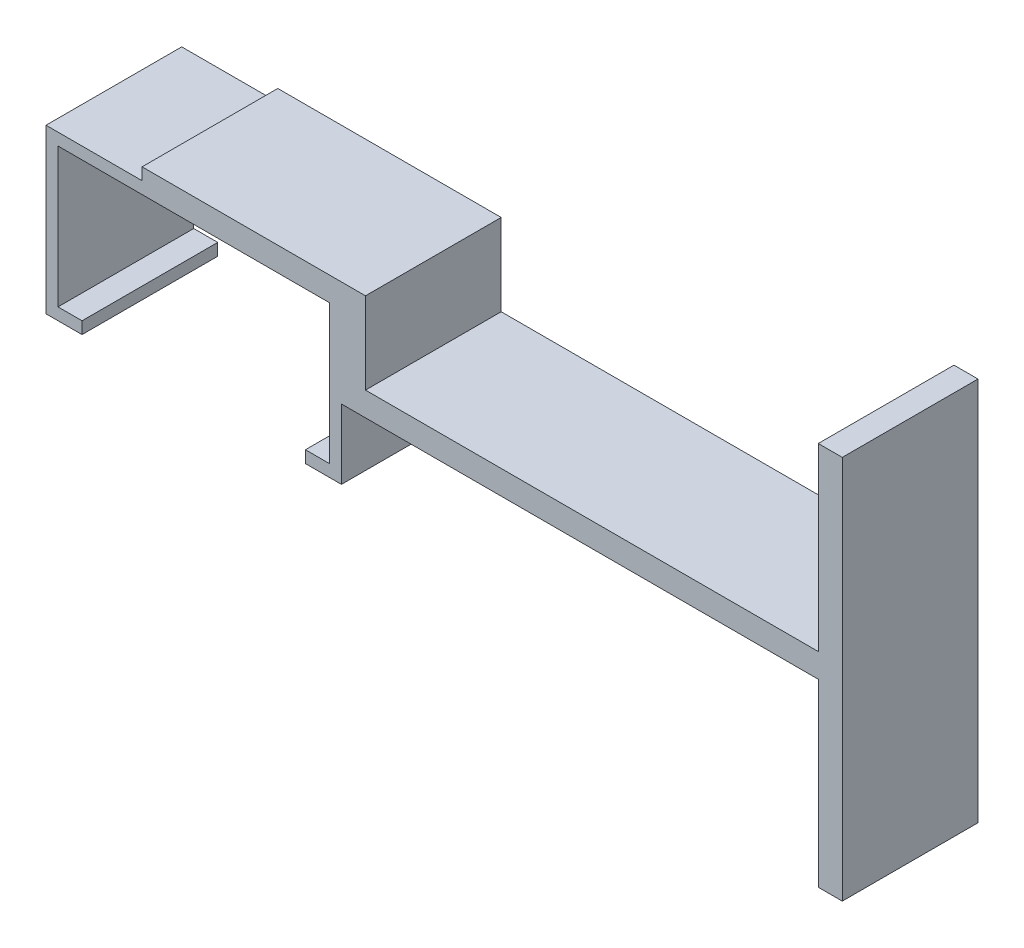
ISO-10303-21;
HEADER;
FILE_DESCRIPTION(('STEP AP214'),'2;1');
FILE_NAME('part.step','',(''),(''),'','','');
FILE_SCHEMA(('AUTOMOTIVE_DESIGN { 1 0 10303 214 1 1 1 1 }'));
ENDSEC;
DATA;
#1=APPLICATION_CONTEXT('core data for automotive mechanical design processes');
#2=APPLICATION_PROTOCOL_DEFINITION('international standard','automotive_design',2000,#1);
#3=PRODUCT_CONTEXT('',#1,'mechanical');
#4=PRODUCT('Part','Part','',(#3));
#5=PRODUCT_RELATED_PRODUCT_CATEGORY('part','',(#4));
#6=PRODUCT_DEFINITION_FORMATION('','',#4);
#7=PRODUCT_DEFINITION_CONTEXT('part definition',#1,'design');
#8=PRODUCT_DEFINITION('design','',#6,#7);
#9=PRODUCT_DEFINITION_SHAPE('','',#8);
#10=(LENGTH_UNIT() NAMED_UNIT(*) SI_UNIT(.MILLI.,.METRE.));
#11=(NAMED_UNIT(*) PLANE_ANGLE_UNIT() SI_UNIT($,.RADIAN.));
#12=(NAMED_UNIT(*) SI_UNIT($,.STERADIAN.) SOLID_ANGLE_UNIT());
#13=UNCERTAINTY_MEASURE_WITH_UNIT(LENGTH_MEASURE(1.E-05),#10,'distance_accuracy_value','');
#14=(GEOMETRIC_REPRESENTATION_CONTEXT(3) GLOBAL_UNCERTAINTY_ASSIGNED_CONTEXT((#13)) GLOBAL_UNIT_ASSIGNED_CONTEXT((#10,
#11,#12)) REPRESENTATION_CONTEXT('',''));
#15=CARTESIAN_POINT('',(0.,0.,0.));
#16=DIRECTION('',(0.,0.,1.));
#17=DIRECTION('',(1.,0.,0.));
#18=AXIS2_PLACEMENT_3D('',#15,#16,#17);
#19=CARTESIAN_POINT('',(41.7,7.8,11.3));
#20=DIRECTION('',(0.,-1.,0.));
#21=DIRECTION('',(0.,0.,-1.));
#22=AXIS2_PLACEMENT_3D('',#19,#20,#21);
#23=PLANE('',#22);
#24=DIRECTION('',(0.,0.,1.));
#25=VECTOR('',#24,1.);
#26=CARTESIAN_POINT('',(39.7,7.8,11.3));
#27=LINE('',#26,#25);
#28=CARTESIAN_POINT('',(39.7,7.8,0.));
#29=VERTEX_POINT('',#28);
#30=CARTESIAN_POINT('',(39.7,7.8,11.3));
#31=VERTEX_POINT('',#30);
#32=EDGE_CURVE('E220',#29,#31,#27,.T.);
#33=ORIENTED_EDGE('',*,*,#32,.F.);
#34=DIRECTION('',(-1.,0.,0.));
#35=VECTOR('',#34,1.);
#36=CARTESIAN_POINT('',(41.7,7.8,0.));
#37=LINE('',#36,#35);
#38=CARTESIAN_POINT('',(2.,7.8,0.));
#39=VERTEX_POINT('',#38);
#40=EDGE_CURVE('E55',#29,#39,#37,.T.);
#41=ORIENTED_EDGE('',*,*,#40,.T.);
#42=DIRECTION('',(0.,0.,1.));
#43=VECTOR('',#42,1.);
#44=CARTESIAN_POINT('',(2.,7.8,11.3));
#45=LINE('',#44,#43);
#46=CARTESIAN_POINT('',(2.,7.8,11.3));
#47=VERTEX_POINT('',#46);
#48=EDGE_CURVE('E256',#39,#47,#45,.T.);
#49=ORIENTED_EDGE('',*,*,#48,.T.);
#50=DIRECTION('',(-1.,0.,0.));
#51=VECTOR('',#50,1.);
#52=CARTESIAN_POINT('',(41.7,7.8,11.3));
#53=LINE('',#52,#51);
#54=EDGE_CURVE('E202',#31,#47,#53,.T.);
#55=ORIENTED_EDGE('',*,*,#54,.F.);
#56=EDGE_LOOP('',(#33,#41,#49,#55));
#57=FACE_BOUND('',#56,.T.);
#58=ADVANCED_FACE('F39',(#57),#23,.F.);
#59=CARTESIAN_POINT('',(0.,5.8,0.));
#60=DIRECTION('',(0.,1.,0.));
#61=DIRECTION('',(0.,0.,1.));
#62=AXIS2_PLACEMENT_3D('',#59,#60,#61);
#63=PLANE('',#62);
#64=DIRECTION('',(0.,0.,-1.));
#65=VECTOR('',#64,1.);
#66=CARTESIAN_POINT('',(39.7,5.8,0.));
#67=LINE('',#66,#65);
#68=CARTESIAN_POINT('',(39.7,5.8,11.3));
#69=VERTEX_POINT('',#68);
#70=CARTESIAN_POINT('',(39.7,5.8,0.));
#71=VERTEX_POINT('',#70);
#72=EDGE_CURVE('E235',#69,#71,#67,.T.);
#73=ORIENTED_EDGE('',*,*,#72,.F.);
#74=DIRECTION('',(-1.,0.,0.));
#75=VECTOR('',#74,1.);
#76=CARTESIAN_POINT('',(2.,5.8,11.3));
#77=LINE('',#76,#75);
#78=CARTESIAN_POINT('',(0.,5.8,11.3));
#79=VERTEX_POINT('',#78);
#80=EDGE_CURVE('E265',#69,#79,#77,.T.);
#81=ORIENTED_EDGE('',*,*,#80,.T.);
#82=DIRECTION('',(0.,0.,-1.));
#83=VECTOR('',#82,1.);
#84=CARTESIAN_POINT('',(0.,5.8,11.3));
#85=LINE('',#84,#83);
#86=CARTESIAN_POINT('',(0.,5.8,0.));
#87=VERTEX_POINT('',#86);
#88=EDGE_CURVE('E268',#79,#87,#85,.T.);
#89=ORIENTED_EDGE('',*,*,#88,.T.);
#90=DIRECTION('',(1.,0.,0.));
#91=VECTOR('',#90,1.);
#92=CARTESIAN_POINT('',(2.,5.8,0.));
#93=LINE('',#92,#91);
#94=EDGE_CURVE('E271',#87,#71,#93,.T.);
#95=ORIENTED_EDGE('',*,*,#94,.T.);
#96=EDGE_LOOP('',(#73,#81,#89,#95));
#97=FACE_BOUND('',#96,.T.);
#98=ADVANCED_FACE('F473',(#97),#63,.F.);
#99=CARTESIAN_POINT('',(2.,0.,0.));
#100=DIRECTION('',(-1.,0.,0.));
#101=DIRECTION('',(0.,0.,1.));
#102=AXIS2_PLACEMENT_3D('',#99,#100,#101);
#103=PLANE('',#102);
#104=ORIENTED_EDGE('',*,*,#48,.F.);
#105=DIRECTION('',(0.,1.,0.));
#106=VECTOR('',#105,1.);
#107=CARTESIAN_POINT('',(2.,13.6,0.));
#108=LINE('',#107,#106);
#109=CARTESIAN_POINT('',(2.,14.6,0.));
#110=VERTEX_POINT('',#109);
#111=EDGE_CURVE('E279',#39,#110,#108,.T.);
#112=ORIENTED_EDGE('',*,*,#111,.T.);
#113=DIRECTION('',(0.,0.,1.));
#114=VECTOR('',#113,1.);
#115=CARTESIAN_POINT('',(2.,14.6,11.3));
#116=LINE('',#115,#114);
#117=CARTESIAN_POINT('',(2.,14.6,11.3));
#118=VERTEX_POINT('',#117);
#119=EDGE_CURVE('E282',#110,#118,#116,.T.);
#120=ORIENTED_EDGE('',*,*,#119,.T.);
#121=DIRECTION('',(0.,-1.,0.));
#122=VECTOR('',#121,1.);
#123=CARTESIAN_POINT('',(2.,13.6,11.3));
#124=LINE('',#123,#122);
#125=EDGE_CURVE('E275',#118,#47,#124,.T.);
#126=ORIENTED_EDGE('',*,*,#125,.T.);
#127=EDGE_LOOP('',(#104,#112,#120,#126));
#128=FACE_BOUND('',#127,.T.);
#129=ADVANCED_FACE('F455',(#128),#103,.F.);
#130=CARTESIAN_POINT('',(0.,0.,11.3));
#131=DIRECTION('',(-1.,0.,0.));
#132=DIRECTION('',(0.,0.,1.));
#133=AXIS2_PLACEMENT_3D('',#130,#131,#132);
#134=PLANE('',#133);
#135=ORIENTED_EDGE('',*,*,#88,.F.);
#136=DIRECTION('',(0.,1.,0.));
#137=VECTOR('',#136,1.);
#138=CARTESIAN_POINT('',(0.,0.,11.3));
#139=LINE('',#138,#137);
#140=CARTESIAN_POINT('',(0.,0.,11.3));
#141=VERTEX_POINT('',#140);
#142=EDGE_CURVE('E308',#141,#79,#139,.T.);
#143=ORIENTED_EDGE('',*,*,#142,.F.);
#144=DIRECTION('',(0.,0.,-1.));
#145=VECTOR('',#144,1.);
#146=CARTESIAN_POINT('',(0.,0.,11.3));
#147=LINE('',#146,#145);
#148=CARTESIAN_POINT('',(0.,0.,0.));
#149=VERTEX_POINT('',#148);
#150=EDGE_CURVE('E345',#141,#149,#147,.T.);
#151=ORIENTED_EDGE('',*,*,#150,.T.);
#152=DIRECTION('',(0.,1.,0.));
#153=VECTOR('',#152,1.);
#154=CARTESIAN_POINT('',(0.,0.,0.));
#155=LINE('',#154,#153);
#156=EDGE_CURVE('E307',#149,#87,#155,.T.);
#157=ORIENTED_EDGE('',*,*,#156,.T.);
#158=EDGE_LOOP('',(#135,#143,#151,#157));
#159=FACE_BOUND('',#158,.T.);
#160=ADVANCED_FACE('F41',(#159),#134,.F.);
#161=CARTESIAN_POINT('',(0.,13.6,11.3));
#162=DIRECTION('',(0.,-1.,0.));
#163=DIRECTION('',(1.,0.,0.));
#164=AXIS2_PLACEMENT_3D('',#161,#162,#163);
#165=PLANE('',#164);
#166=DIRECTION('',(0.,0.,1.));
#167=VECTOR('',#166,1.);
#168=CARTESIAN_POINT('',(-16.6,13.6,0.));
#169=LINE('',#168,#167);
#170=CARTESIAN_POINT('',(-16.6,13.6,0.));
#171=VERTEX_POINT('',#170);
#172=CARTESIAN_POINT('',(-16.6,13.6,11.3));
#173=VERTEX_POINT('',#172);
#174=EDGE_CURVE('E286',#171,#173,#169,.T.);
#175=ORIENTED_EDGE('',*,*,#174,.F.);
#176=DIRECTION('',(-1.,0.,0.));
#177=VECTOR('',#176,1.);
#178=CARTESIAN_POINT('',(0.,13.6,0.));
#179=LINE('',#178,#177);
#180=CARTESIAN_POINT('',(-24.6,13.6,0.));
#181=VERTEX_POINT('',#180);
#182=EDGE_CURVE('E349',#171,#181,#179,.T.);
#183=ORIENTED_EDGE('',*,*,#182,.T.);
#184=DIRECTION('',(0.,0.,-1.));
#185=VECTOR('',#184,1.);
#186=CARTESIAN_POINT('',(-24.6,13.6,11.3));
#187=LINE('',#186,#185);
#188=CARTESIAN_POINT('',(-24.6,13.6,11.3));
#189=VERTEX_POINT('',#188);
#190=EDGE_CURVE('E11',#189,#181,#187,.T.);
#191=ORIENTED_EDGE('',*,*,#190,.F.);
#192=DIRECTION('',(-1.,0.,0.));
#193=VECTOR('',#192,1.);
#194=CARTESIAN_POINT('',(0.,13.6,11.3));
#195=LINE('',#194,#193);
#196=EDGE_CURVE('E63',#173,#189,#195,.T.);
#197=ORIENTED_EDGE('',*,*,#196,.F.);
#198=EDGE_LOOP('',(#175,#183,#191,#197));
#199=FACE_BOUND('',#198,.T.);
#200=ADVANCED_FACE('F443',(#199),#165,.F.);
#201=CARTESIAN_POINT('',(-24.6,0.,11.3));
#202=DIRECTION('',(1.,0.,0.));
#203=DIRECTION('',(0.,0.,-1.));
#204=AXIS2_PLACEMENT_3D('',#201,#202,#203);
#205=PLANE('',#204);
#206=DIRECTION('',(0.,-1.,0.));
#207=VECTOR('',#206,1.);
#208=CARTESIAN_POINT('',(-24.6,0.,0.));
#209=LINE('',#208,#207);
#210=CARTESIAN_POINT('',(-24.6,0.,0.));
#211=VERTEX_POINT('',#210);
#212=EDGE_CURVE('E352',#181,#211,#209,.T.);
#213=ORIENTED_EDGE('',*,*,#212,.T.);
#214=DIRECTION('',(0.,0.,-1.));
#215=VECTOR('',#214,1.);
#216=CARTESIAN_POINT('',(-24.6,0.,11.3));
#217=LINE('',#216,#215);
#218=CARTESIAN_POINT('',(-24.6,0.,11.3));
#219=VERTEX_POINT('',#218);
#220=EDGE_CURVE('E48',#219,#211,#217,.T.);
#221=ORIENTED_EDGE('',*,*,#220,.F.);
#222=DIRECTION('',(0.,-1.,0.));
#223=VECTOR('',#222,1.);
#224=CARTESIAN_POINT('',(-24.6,0.,11.3));
#225=LINE('',#224,#223);
#226=EDGE_CURVE('E315',#189,#219,#225,.T.);
#227=ORIENTED_EDGE('',*,*,#226,.F.);
#228=ORIENTED_EDGE('',*,*,#190,.T.);
#229=EDGE_LOOP('',(#213,#221,#227,#228));
#230=FACE_BOUND('',#229,.T.);
#231=ADVANCED_FACE('F442',(#230),#205,.F.);
#232=CARTESIAN_POINT('',(-21.6,0.,11.3));
#233=DIRECTION('',(0.,1.,0.));
#234=DIRECTION('',(-1.,0.,0.));
#235=AXIS2_PLACEMENT_3D('',#232,#233,#234);
#236=PLANE('',#235);
#237=DIRECTION('',(1.,0.,0.));
#238=VECTOR('',#237,1.);
#239=CARTESIAN_POINT('',(-21.6,0.,0.));
#240=LINE('',#239,#238);
#241=CARTESIAN_POINT('',(-21.6,0.,0.));
#242=VERTEX_POINT('',#241);
#243=EDGE_CURVE('E355',#211,#242,#240,.T.);
#244=ORIENTED_EDGE('',*,*,#243,.T.);
#245=DIRECTION('',(0.,0.,-1.));
#246=VECTOR('',#245,1.);
#247=CARTESIAN_POINT('',(-21.6,0.,11.3));
#248=LINE('',#247,#246);
#249=CARTESIAN_POINT('',(-21.6,0.,11.3));
#250=VERTEX_POINT('',#249);
#251=EDGE_CURVE('E412',#250,#242,#248,.T.);
#252=ORIENTED_EDGE('',*,*,#251,.F.);
#253=DIRECTION('',(1.,0.,0.));
#254=VECTOR('',#253,1.);
#255=CARTESIAN_POINT('',(-21.6,0.,11.3));
#256=LINE('',#255,#254);
#257=EDGE_CURVE('E318',#219,#250,#256,.T.);
#258=ORIENTED_EDGE('',*,*,#257,.F.);
#259=ORIENTED_EDGE('',*,*,#220,.T.);
#260=EDGE_LOOP('',(#244,#252,#258,#259));
#261=FACE_BOUND('',#260,.T.);
#262=ADVANCED_FACE('F421',(#261),#236,.F.);
#263=CARTESIAN_POINT('',(-21.6,0.999999999999997,11.3));
#264=DIRECTION('',(-1.,0.,0.));
#265=DIRECTION('',(0.,0.,1.));
#266=AXIS2_PLACEMENT_3D('',#263,#264,#265);
#267=PLANE('',#266);
#268=DIRECTION('',(0.,1.,0.));
#269=VECTOR('',#268,1.);
#270=CARTESIAN_POINT('',(-21.6,0.999999999999997,0.));
#271=LINE('',#270,#269);
#272=CARTESIAN_POINT('',(-21.6,0.999999999999997,0.));
#273=VERTEX_POINT('',#272);
#274=EDGE_CURVE('E358',#242,#273,#271,.T.);
#275=ORIENTED_EDGE('',*,*,#274,.T.);
#276=DIRECTION('',(0.,0.,-1.));
#277=VECTOR('',#276,1.);
#278=CARTESIAN_POINT('',(-21.6,0.999999999999997,11.3));
#279=LINE('',#278,#277);
#280=CARTESIAN_POINT('',(-21.6,0.999999999999997,11.3));
#281=VERTEX_POINT('',#280);
#282=EDGE_CURVE('E408',#281,#273,#279,.T.);
#283=ORIENTED_EDGE('',*,*,#282,.F.);
#284=DIRECTION('',(0.,1.,0.));
#285=VECTOR('',#284,1.);
#286=CARTESIAN_POINT('',(-21.6,0.999999999999997,11.3));
#287=LINE('',#286,#285);
#288=EDGE_CURVE('E321',#250,#281,#287,.T.);
#289=ORIENTED_EDGE('',*,*,#288,.F.);
#290=ORIENTED_EDGE('',*,*,#251,.T.);
#291=EDGE_LOOP('',(#275,#283,#289,#290));
#292=FACE_BOUND('',#291,.T.);
#293=ADVANCED_FACE('F432',(#292),#267,.F.);
#294=CARTESIAN_POINT('',(-23.6,0.999999999999997,11.3));
#295=DIRECTION('',(0.,-1.,0.));
#296=DIRECTION('',(1.,0.,0.));
#297=AXIS2_PLACEMENT_3D('',#294,#295,#296);
#298=PLANE('',#297);
#299=DIRECTION('',(-1.,0.,0.));
#300=VECTOR('',#299,1.);
#301=CARTESIAN_POINT('',(-23.6,0.999999999999997,0.));
#302=LINE('',#301,#300);
#303=CARTESIAN_POINT('',(-23.6,0.999999999999997,0.));
#304=VERTEX_POINT('',#303);
#305=EDGE_CURVE('E361',#273,#304,#302,.T.);
#306=ORIENTED_EDGE('',*,*,#305,.T.);
#307=DIRECTION('',(0.,0.,-1.));
#308=VECTOR('',#307,1.);
#309=CARTESIAN_POINT('',(-23.6,0.999999999999997,11.3));
#310=LINE('',#309,#308);
#311=CARTESIAN_POINT('',(-23.6,0.999999999999997,11.3));
#312=VERTEX_POINT('',#311);
#313=EDGE_CURVE('E404',#312,#304,#310,.T.);
#314=ORIENTED_EDGE('',*,*,#313,.F.);
#315=DIRECTION('',(-1.,0.,0.));
#316=VECTOR('',#315,1.);
#317=CARTESIAN_POINT('',(-23.6,0.999999999999997,11.3));
#318=LINE('',#317,#316);
#319=EDGE_CURVE('E324',#281,#312,#318,.T.);
#320=ORIENTED_EDGE('',*,*,#319,.F.);
#321=ORIENTED_EDGE('',*,*,#282,.T.);
#322=EDGE_LOOP('',(#306,#314,#320,#321));
#323=FACE_BOUND('',#322,.T.);
#324=ADVANCED_FACE('F436',(#323),#298,.F.);
#325=CARTESIAN_POINT('',(-23.6,12.6,11.3));
#326=DIRECTION('',(-1.,0.,0.));
#327=DIRECTION('',(0.,0.,1.));
#328=AXIS2_PLACEMENT_3D('',#325,#326,#327);
#329=PLANE('',#328);
#330=DIRECTION('',(0.,1.,0.));
#331=VECTOR('',#330,1.);
#332=CARTESIAN_POINT('',(-23.6,12.6,0.));
#333=LINE('',#332,#331);
#334=CARTESIAN_POINT('',(-23.6,12.6,0.));
#335=VERTEX_POINT('',#334);
#336=EDGE_CURVE('E364',#304,#335,#333,.T.);
#337=ORIENTED_EDGE('',*,*,#336,.T.);
#338=DIRECTION('',(0.,0.,-1.));
#339=VECTOR('',#338,1.);
#340=CARTESIAN_POINT('',(-23.6,12.6,11.3));
#341=LINE('',#340,#339);
#342=CARTESIAN_POINT('',(-23.6,12.6,11.3));
#343=VERTEX_POINT('',#342);
#344=EDGE_CURVE('E400',#343,#335,#341,.T.);
#345=ORIENTED_EDGE('',*,*,#344,.F.);
#346=DIRECTION('',(0.,1.,0.));
#347=VECTOR('',#346,1.);
#348=CARTESIAN_POINT('',(-23.6,12.6,11.3));
#349=LINE('',#348,#347);
#350=EDGE_CURVE('E327',#312,#343,#349,.T.);
#351=ORIENTED_EDGE('',*,*,#350,.F.);
#352=ORIENTED_EDGE('',*,*,#313,.T.);
#353=EDGE_LOOP('',(#337,#345,#351,#352));
#354=FACE_BOUND('',#353,.T.);
#355=ADVANCED_FACE('F512',(#354),#329,.F.);
#356=CARTESIAN_POINT('',(-23.6,12.6,11.3));
#357=DIRECTION('',(0.,1.,0.));
#358=DIRECTION('',(-1.,0.,0.));
#359=AXIS2_PLACEMENT_3D('',#356,#357,#358);
#360=PLANE('',#359);
#361=DIRECTION('',(1.,0.,0.));
#362=VECTOR('',#361,1.);
#363=CARTESIAN_POINT('',(-23.6,12.6,0.));
#364=LINE('',#363,#362);
#365=CARTESIAN_POINT('',(-1.,12.6,0.));
#366=VERTEX_POINT('',#365);
#367=EDGE_CURVE('E367',#335,#366,#364,.T.);
#368=ORIENTED_EDGE('',*,*,#367,.T.);
#369=DIRECTION('',(0.,0.,-1.));
#370=VECTOR('',#369,1.);
#371=CARTESIAN_POINT('',(-1.,12.6,11.3));
#372=LINE('',#371,#370);
#373=CARTESIAN_POINT('',(-1.,12.6,11.3));
#374=VERTEX_POINT('',#373);
#375=EDGE_CURVE('E396',#374,#366,#372,.T.);
#376=ORIENTED_EDGE('',*,*,#375,.F.);
#377=DIRECTION('',(1.,0.,0.));
#378=VECTOR('',#377,1.);
#379=CARTESIAN_POINT('',(-23.6,12.6,11.3));
#380=LINE('',#379,#378);
#381=EDGE_CURVE('E330',#343,#374,#380,.T.);
#382=ORIENTED_EDGE('',*,*,#381,.F.);
#383=ORIENTED_EDGE('',*,*,#344,.T.);
#384=EDGE_LOOP('',(#368,#376,#382,#383));
#385=FACE_BOUND('',#384,.T.);
#386=ADVANCED_FACE('F508',(#385),#360,.F.);
#387=CARTESIAN_POINT('',(-1.,12.6,11.3));
#388=DIRECTION('',(1.,0.,0.));
#389=DIRECTION('',(0.,0.,-1.));
#390=AXIS2_PLACEMENT_3D('',#387,#388,#389);
#391=PLANE('',#390);
#392=DIRECTION('',(0.,-1.,0.));
#393=VECTOR('',#392,1.);
#394=CARTESIAN_POINT('',(-1.,12.6,0.));
#395=LINE('',#394,#393);
#396=CARTESIAN_POINT('',(-1.,0.999999999999997,0.));
#397=VERTEX_POINT('',#396);
#398=EDGE_CURVE('E370',#366,#397,#395,.T.);
#399=ORIENTED_EDGE('',*,*,#398,.T.);
#400=DIRECTION('',(0.,0.,-1.));
#401=VECTOR('',#400,1.);
#402=CARTESIAN_POINT('',(-1.,0.999999999999997,11.3));
#403=LINE('',#402,#401);
#404=CARTESIAN_POINT('',(-1.,0.999999999999997,11.3));
#405=VERTEX_POINT('',#404);
#406=EDGE_CURVE('E392',#405,#397,#403,.T.);
#407=ORIENTED_EDGE('',*,*,#406,.F.);
#408=DIRECTION('',(0.,-1.,0.));
#409=VECTOR('',#408,1.);
#410=CARTESIAN_POINT('',(-1.,12.6,11.3));
#411=LINE('',#410,#409);
#412=EDGE_CURVE('E333',#374,#405,#411,.T.);
#413=ORIENTED_EDGE('',*,*,#412,.F.);
#414=ORIENTED_EDGE('',*,*,#375,.T.);
#415=EDGE_LOOP('',(#399,#407,#413,#414));
#416=FACE_BOUND('',#415,.T.);
#417=ADVANCED_FACE('F504',(#416),#391,.F.);
#418=CARTESIAN_POINT('',(-3.,0.999999999999997,11.3));
#419=DIRECTION('',(0.,-1.,0.));
#420=DIRECTION('',(0.,0.,-1.));
#421=AXIS2_PLACEMENT_3D('',#418,#419,#420);
#422=PLANE('',#421);
#423=DIRECTION('',(-1.,0.,0.));
#424=VECTOR('',#423,1.);
#425=CARTESIAN_POINT('',(-3.,0.999999999999997,0.));
#426=LINE('',#425,#424);
#427=CARTESIAN_POINT('',(-3.,0.999999999999997,0.));
#428=VERTEX_POINT('',#427);
#429=EDGE_CURVE('E373',#397,#428,#426,.T.);
#430=ORIENTED_EDGE('',*,*,#429,.T.);
#431=DIRECTION('',(0.,0.,-1.));
#432=VECTOR('',#431,1.);
#433=CARTESIAN_POINT('',(-3.,0.999999999999997,11.3));
#434=LINE('',#433,#432);
#435=CARTESIAN_POINT('',(-3.,0.999999999999997,11.3));
#436=VERTEX_POINT('',#435);
#437=EDGE_CURVE('E388',#436,#428,#434,.T.);
#438=ORIENTED_EDGE('',*,*,#437,.F.);
#439=DIRECTION('',(-1.,0.,0.));
#440=VECTOR('',#439,1.);
#441=CARTESIAN_POINT('',(-3.,0.999999999999997,11.3));
#442=LINE('',#441,#440);
#443=EDGE_CURVE('E336',#405,#436,#442,.T.);
#444=ORIENTED_EDGE('',*,*,#443,.F.);
#445=ORIENTED_EDGE('',*,*,#406,.T.);
#446=EDGE_LOOP('',(#430,#438,#444,#445));
#447=FACE_BOUND('',#446,.T.);
#448=ADVANCED_FACE('F500',(#447),#422,.F.);
#449=CARTESIAN_POINT('',(-3.,0.999999999999997,11.3));
#450=DIRECTION('',(1.,0.,0.));
#451=DIRECTION('',(0.,0.,-1.));
#452=AXIS2_PLACEMENT_3D('',#449,#450,#451);
#453=PLANE('',#452);
#454=DIRECTION('',(0.,-1.,0.));
#455=VECTOR('',#454,1.);
#456=CARTESIAN_POINT('',(-3.,0.999999999999997,0.));
#457=LINE('',#456,#455);
#458=CARTESIAN_POINT('',(-3.,0.,0.));
#459=VERTEX_POINT('',#458);
#460=EDGE_CURVE('E376',#428,#459,#457,.T.);
#461=ORIENTED_EDGE('',*,*,#460,.T.);
#462=DIRECTION('',(0.,0.,-1.));
#463=VECTOR('',#462,1.);
#464=CARTESIAN_POINT('',(-3.,0.,11.3));
#465=LINE('',#464,#463);
#466=CARTESIAN_POINT('',(-3.,0.,11.3));
#467=VERTEX_POINT('',#466);
#468=EDGE_CURVE('E384',#467,#459,#465,.T.);
#469=ORIENTED_EDGE('',*,*,#468,.F.);
#470=DIRECTION('',(0.,-1.,0.));
#471=VECTOR('',#470,1.);
#472=CARTESIAN_POINT('',(-3.,0.999999999999997,11.3));
#473=LINE('',#472,#471);
#474=EDGE_CURVE('E339',#436,#467,#473,.T.);
#475=ORIENTED_EDGE('',*,*,#474,.F.);
#476=ORIENTED_EDGE('',*,*,#437,.T.);
#477=EDGE_LOOP('',(#461,#469,#475,#476));
#478=FACE_BOUND('',#477,.T.);
#479=ADVANCED_FACE('F496',(#478),#453,.F.);
#480=CARTESIAN_POINT('',(0.,0.,11.3));
#481=DIRECTION('',(0.,1.,0.));
#482=DIRECTION('',(-1.,0.,0.));
#483=AXIS2_PLACEMENT_3D('',#480,#481,#482);
#484=PLANE('',#483);
#485=DIRECTION('',(1.,0.,0.));
#486=VECTOR('',#485,1.);
#487=CARTESIAN_POINT('',(0.,0.,0.));
#488=LINE('',#487,#486);
#489=EDGE_CURVE('E312',#459,#149,#488,.T.);
#490=ORIENTED_EDGE('',*,*,#489,.T.);
#491=ORIENTED_EDGE('',*,*,#150,.F.);
#492=DIRECTION('',(1.,0.,0.));
#493=VECTOR('',#492,1.);
#494=CARTESIAN_POINT('',(0.,0.,11.3));
#495=LINE('',#494,#493);
#496=EDGE_CURVE('E342',#467,#141,#495,.T.);
#497=ORIENTED_EDGE('',*,*,#496,.F.);
#498=ORIENTED_EDGE('',*,*,#468,.T.);
#499=EDGE_LOOP('',(#490,#491,#497,#498));
#500=FACE_BOUND('',#499,.T.);
#501=ADVANCED_FACE('F491',(#500),#484,.F.);
#502=CARTESIAN_POINT('',(0.,0.,11.3));
#503=DIRECTION('',(0.,0.,1.));
#504=DIRECTION('',(1.,0.,0.));
#505=AXIS2_PLACEMENT_3D('',#502,#503,#504);
#506=PLANE('',#505);
#507=ORIENTED_EDGE('',*,*,#142,.T.);
#508=ORIENTED_EDGE('',*,*,#80,.F.);
#509=DIRECTION('',(0.,1.,0.));
#510=VECTOR('',#509,1.);
#511=CARTESIAN_POINT('',(39.7,-9.2,11.3));
#512=LINE('',#511,#510);
#513=CARTESIAN_POINT('',(39.7,-9.2,11.3));
#514=VERTEX_POINT('',#513);
#515=EDGE_CURVE('E253',#514,#69,#512,.T.);
#516=ORIENTED_EDGE('',*,*,#515,.F.);
#517=DIRECTION('',(-1.,0.,0.));
#518=VECTOR('',#517,1.);
#519=CARTESIAN_POINT('',(41.7,-9.2,11.3));
#520=LINE('',#519,#518);
#521=CARTESIAN_POINT('',(41.7,-9.2,11.3));
#522=VERTEX_POINT('',#521);
#523=EDGE_CURVE('E238',#522,#514,#520,.T.);
#524=ORIENTED_EDGE('',*,*,#523,.F.);
#525=DIRECTION('',(0.,-1.,0.));
#526=VECTOR('',#525,1.);
#527=CARTESIAN_POINT('',(41.7,5.8,11.3));
#528=LINE('',#527,#526);
#529=CARTESIAN_POINT('',(41.7,22.8,11.3));
#530=VERTEX_POINT('',#529);
#531=EDGE_CURVE('E203',#530,#522,#528,.T.);
#532=ORIENTED_EDGE('',*,*,#531,.F.);
#533=DIRECTION('',(1.,0.,0.));
#534=VECTOR('',#533,1.);
#535=CARTESIAN_POINT('',(41.7,22.8,11.3));
#536=LINE('',#535,#534);
#537=CARTESIAN_POINT('',(39.7,22.8,11.3));
#538=VERTEX_POINT('',#537);
#539=EDGE_CURVE('E218',#538,#530,#536,.T.);
#540=ORIENTED_EDGE('',*,*,#539,.F.);
#541=DIRECTION('',(0.,-1.,0.));
#542=VECTOR('',#541,1.);
#543=CARTESIAN_POINT('',(39.7,22.8,11.3));
#544=LINE('',#543,#542);
#545=EDGE_CURVE('E228',#538,#31,#544,.T.);
#546=ORIENTED_EDGE('',*,*,#545,.T.);
#547=ORIENTED_EDGE('',*,*,#54,.T.);
#548=ORIENTED_EDGE('',*,*,#125,.F.);
#549=DIRECTION('',(1.,0.,0.));
#550=VECTOR('',#549,1.);
#551=CARTESIAN_POINT('',(-16.6,14.6,11.3));
#552=LINE('',#551,#550);
#553=CARTESIAN_POINT('',(-16.6,14.6,11.3));
#554=VERTEX_POINT('',#553);
#555=EDGE_CURVE('E291',#554,#118,#552,.T.);
#556=ORIENTED_EDGE('',*,*,#555,.F.);
#557=DIRECTION('',(0.,-1.,0.));
#558=VECTOR('',#557,1.);
#559=CARTESIAN_POINT('',(-16.6,14.6,11.3));
#560=LINE('',#559,#558);
#561=EDGE_CURVE('E304',#554,#173,#560,.T.);
#562=ORIENTED_EDGE('',*,*,#561,.T.);
#563=ORIENTED_EDGE('',*,*,#196,.T.);
#564=ORIENTED_EDGE('',*,*,#226,.T.);
#565=ORIENTED_EDGE('',*,*,#257,.T.);
#566=ORIENTED_EDGE('',*,*,#288,.T.);
#567=ORIENTED_EDGE('',*,*,#319,.T.);
#568=ORIENTED_EDGE('',*,*,#350,.T.);
#569=ORIENTED_EDGE('',*,*,#381,.T.);
#570=ORIENTED_EDGE('',*,*,#412,.T.);
#571=ORIENTED_EDGE('',*,*,#443,.T.);
#572=ORIENTED_EDGE('',*,*,#474,.T.);
#573=ORIENTED_EDGE('',*,*,#496,.T.);
#574=EDGE_LOOP('',(#507,#508,#516,#524,#532,#540,#546,#547,#548,#556,#562,#563,#564,#565,#566,
#567,#568,#569,#570,#571,#572,#573));
#575=FACE_BOUND('',#574,.T.);
#576=ADVANCED_FACE('F440',(#575),#506,.T.);
#577=CARTESIAN_POINT('',(0.,0.,0.));
#578=DIRECTION('',(0.,0.,1.));
#579=DIRECTION('',(1.,0.,0.));
#580=AXIS2_PLACEMENT_3D('',#577,#578,#579);
#581=PLANE('',#580);
#582=ORIENTED_EDGE('',*,*,#156,.F.);
#583=ORIENTED_EDGE('',*,*,#489,.F.);
#584=ORIENTED_EDGE('',*,*,#460,.F.);
#585=ORIENTED_EDGE('',*,*,#429,.F.);
#586=ORIENTED_EDGE('',*,*,#398,.F.);
#587=ORIENTED_EDGE('',*,*,#367,.F.);
#588=ORIENTED_EDGE('',*,*,#336,.F.);
#589=ORIENTED_EDGE('',*,*,#305,.F.);
#590=ORIENTED_EDGE('',*,*,#274,.F.);
#591=ORIENTED_EDGE('',*,*,#243,.F.);
#592=ORIENTED_EDGE('',*,*,#212,.F.);
#593=ORIENTED_EDGE('',*,*,#182,.F.);
#594=DIRECTION('',(0.,-1.,0.));
#595=VECTOR('',#594,1.);
#596=CARTESIAN_POINT('',(-16.6,14.6,0.));
#597=LINE('',#596,#595);
#598=CARTESIAN_POINT('',(-16.6,14.6,0.));
#599=VERTEX_POINT('',#598);
#600=EDGE_CURVE('E297',#599,#171,#597,.T.);
#601=ORIENTED_EDGE('',*,*,#600,.F.);
#602=DIRECTION('',(-1.,0.,0.));
#603=VECTOR('',#602,1.);
#604=CARTESIAN_POINT('',(-16.6,14.6,0.));
#605=LINE('',#604,#603);
#606=EDGE_CURVE('E294',#110,#599,#605,.T.);
#607=ORIENTED_EDGE('',*,*,#606,.F.);
#608=ORIENTED_EDGE('',*,*,#111,.F.);
#609=ORIENTED_EDGE('',*,*,#40,.F.);
#610=DIRECTION('',(0.,-1.,0.));
#611=VECTOR('',#610,1.);
#612=CARTESIAN_POINT('',(39.7,22.8,0.));
#613=LINE('',#612,#611);
#614=CARTESIAN_POINT('',(39.7,22.8,0.));
#615=VERTEX_POINT('',#614);
#616=EDGE_CURVE('E209',#615,#29,#613,.T.);
#617=ORIENTED_EDGE('',*,*,#616,.F.);
#618=DIRECTION('',(-1.,0.,0.));
#619=VECTOR('',#618,1.);
#620=CARTESIAN_POINT('',(41.7,22.8,0.));
#621=LINE('',#620,#619);
#622=CARTESIAN_POINT('',(41.7,22.8,0.));
#623=VERTEX_POINT('',#622);
#624=EDGE_CURVE('E206',#623,#615,#621,.T.);
#625=ORIENTED_EDGE('',*,*,#624,.F.);
#626=DIRECTION('',(0.,1.,0.));
#627=VECTOR('',#626,1.);
#628=CARTESIAN_POINT('',(41.7,5.8,0.));
#629=LINE('',#628,#627);
#630=CARTESIAN_POINT('',(41.7,-9.2,0.));
#631=VERTEX_POINT('',#630);
#632=EDGE_CURVE('E191',#631,#623,#629,.T.);
#633=ORIENTED_EDGE('',*,*,#632,.F.);
#634=DIRECTION('',(1.,0.,0.));
#635=VECTOR('',#634,1.);
#636=CARTESIAN_POINT('',(41.7,-9.2,0.));
#637=LINE('',#636,#635);
#638=CARTESIAN_POINT('',(39.7,-9.2,0.));
#639=VERTEX_POINT('',#638);
#640=EDGE_CURVE('E244',#639,#631,#637,.T.);
#641=ORIENTED_EDGE('',*,*,#640,.F.);
#642=DIRECTION('',(0.,1.,0.));
#643=VECTOR('',#642,1.);
#644=CARTESIAN_POINT('',(39.7,-9.2,0.));
#645=LINE('',#644,#643);
#646=EDGE_CURVE('E247',#639,#71,#645,.T.);
#647=ORIENTED_EDGE('',*,*,#646,.T.);
#648=ORIENTED_EDGE('',*,*,#94,.F.);
#649=EDGE_LOOP('',(#582,#583,#584,#585,#586,#587,#588,#589,#590,#591,#592,#593,#601,#607,#608,
#609,#617,#625,#633,#641,#647,#648));
#650=FACE_BOUND('',#649,.T.);
#651=ADVANCED_FACE('F208',(#650),#581,.F.);
#652=CARTESIAN_POINT('',(-16.6,14.6,0.));
#653=DIRECTION('',(1.,0.,0.));
#654=DIRECTION('',(0.,1.,0.));
#655=AXIS2_PLACEMENT_3D('',#652,#653,#654);
#656=PLANE('',#655);
#657=ORIENTED_EDGE('',*,*,#174,.T.);
#658=ORIENTED_EDGE('',*,*,#561,.F.);
#659=DIRECTION('',(0.,0.,1.));
#660=VECTOR('',#659,1.);
#661=CARTESIAN_POINT('',(-16.6,14.6,0.));
#662=LINE('',#661,#660);
#663=EDGE_CURVE('E287',#599,#554,#662,.T.);
#664=ORIENTED_EDGE('',*,*,#663,.F.);
#665=ORIENTED_EDGE('',*,*,#600,.T.);
#666=EDGE_LOOP('',(#657,#658,#664,#665));
#667=FACE_BOUND('',#666,.T.);
#668=ADVANCED_FACE('F448',(#667),#656,.F.);
#669=CARTESIAN_POINT('',(0.,14.6,0.));
#670=DIRECTION('',(0.,1.,0.));
#671=DIRECTION('',(-1.,0.,0.));
#672=AXIS2_PLACEMENT_3D('',#669,#670,#671);
#673=PLANE('',#672);
#674=ORIENTED_EDGE('',*,*,#663,.T.);
#675=ORIENTED_EDGE('',*,*,#555,.T.);
#676=ORIENTED_EDGE('',*,*,#119,.F.);
#677=ORIENTED_EDGE('',*,*,#606,.T.);
#678=EDGE_LOOP('',(#674,#675,#676,#677));
#679=FACE_BOUND('',#678,.T.);
#680=ADVANCED_FACE('F451',(#679),#673,.T.);
#681=CARTESIAN_POINT('',(41.7,0.,0.));
#682=DIRECTION('',(-1.,0.,0.));
#683=DIRECTION('',(0.,0.,1.));
#684=AXIS2_PLACEMENT_3D('',#681,#682,#683);
#685=PLANE('',#684);
#686=ORIENTED_EDGE('',*,*,#531,.T.);
#687=DIRECTION('',(0.,0.,1.));
#688=VECTOR('',#687,1.);
#689=CARTESIAN_POINT('',(41.7,-9.2,0.));
#690=LINE('',#689,#688);
#691=EDGE_CURVE('E197',#631,#522,#690,.T.);
#692=ORIENTED_EDGE('',*,*,#691,.F.);
#693=ORIENTED_EDGE('',*,*,#632,.T.);
#694=DIRECTION('',(0.,0.,-1.));
#695=VECTOR('',#694,1.);
#696=CARTESIAN_POINT('',(41.7,22.8,11.3));
#697=LINE('',#696,#695);
#698=EDGE_CURVE('E195',#530,#623,#697,.T.);
#699=ORIENTED_EDGE('',*,*,#698,.F.);
#700=EDGE_LOOP('',(#686,#692,#693,#699));
#701=FACE_BOUND('',#700,.T.);
#702=ADVANCED_FACE('F193',(#701),#685,.F.);
#703=CARTESIAN_POINT('',(39.7,-9.2,0.));
#704=DIRECTION('',(1.,0.,0.));
#705=DIRECTION('',(0.,0.,-1.));
#706=AXIS2_PLACEMENT_3D('',#703,#704,#705);
#707=PLANE('',#706);
#708=ORIENTED_EDGE('',*,*,#72,.T.);
#709=ORIENTED_EDGE('',*,*,#646,.F.);
#710=DIRECTION('',(0.,0.,-1.));
#711=VECTOR('',#710,1.);
#712=CARTESIAN_POINT('',(39.7,-9.2,0.));
#713=LINE('',#712,#711);
#714=EDGE_CURVE('E241',#514,#639,#713,.T.);
#715=ORIENTED_EDGE('',*,*,#714,.F.);
#716=ORIENTED_EDGE('',*,*,#515,.T.);
#717=EDGE_LOOP('',(#708,#709,#715,#716));
#718=FACE_BOUND('',#717,.T.);
#719=ADVANCED_FACE('F469',(#718),#707,.F.);
#720=CARTESIAN_POINT('',(0.,-9.2,0.));
#721=DIRECTION('',(0.,-1.,0.));
#722=DIRECTION('',(0.,0.,-1.));
#723=AXIS2_PLACEMENT_3D('',#720,#721,#722);
#724=PLANE('',#723);
#725=ORIENTED_EDGE('',*,*,#691,.T.);
#726=ORIENTED_EDGE('',*,*,#523,.T.);
#727=ORIENTED_EDGE('',*,*,#714,.T.);
#728=ORIENTED_EDGE('',*,*,#640,.T.);
#729=EDGE_LOOP('',(#725,#726,#727,#728));
#730=FACE_BOUND('',#729,.T.);
#731=ADVANCED_FACE('F462',(#730),#724,.T.);
#732=CARTESIAN_POINT('',(39.7,22.8,11.3));
#733=DIRECTION('',(1.,0.,0.));
#734=DIRECTION('',(0.,0.,-1.));
#735=AXIS2_PLACEMENT_3D('',#732,#733,#734);
#736=PLANE('',#735);
#737=ORIENTED_EDGE('',*,*,#32,.T.);
#738=ORIENTED_EDGE('',*,*,#545,.F.);
#739=DIRECTION('',(0.,0.,1.));
#740=VECTOR('',#739,1.);
#741=CARTESIAN_POINT('',(39.7,22.8,11.3));
#742=LINE('',#741,#740);
#743=EDGE_CURVE('E213',#615,#538,#742,.T.);
#744=ORIENTED_EDGE('',*,*,#743,.F.);
#745=ORIENTED_EDGE('',*,*,#616,.T.);
#746=EDGE_LOOP('',(#737,#738,#744,#745));
#747=FACE_BOUND('',#746,.T.);
#748=ADVANCED_FACE('F460',(#747),#736,.F.);
#749=CARTESIAN_POINT('',(0.,22.8,0.));
#750=DIRECTION('',(0.,1.,0.));
#751=DIRECTION('',(0.,0.,1.));
#752=AXIS2_PLACEMENT_3D('',#749,#750,#751);
#753=PLANE('',#752);
#754=ORIENTED_EDGE('',*,*,#698,.T.);
#755=ORIENTED_EDGE('',*,*,#624,.T.);
#756=ORIENTED_EDGE('',*,*,#743,.T.);
#757=ORIENTED_EDGE('',*,*,#539,.T.);
#758=EDGE_LOOP('',(#754,#755,#756,#757));
#759=FACE_BOUND('',#758,.T.);
#760=ADVANCED_FACE('F216',(#759),#753,.T.);
#761=CLOSED_SHELL('',(#58,#98,#129,#160,#200,#231,#262,#293,#324,#355,#386,#417,#448,#479,#501,
#576,#651,#668,#680,#702,#719,#731,#748,#760));
#762=MANIFOLD_SOLID_BREP('B2',#761);
#763=ADVANCED_BREP_SHAPE_REPRESENTATION('',(#18,#762),#14);
#764=SHAPE_DEFINITION_REPRESENTATION(#9,#763);
ENDSEC;
END-ISO-10303-21;
